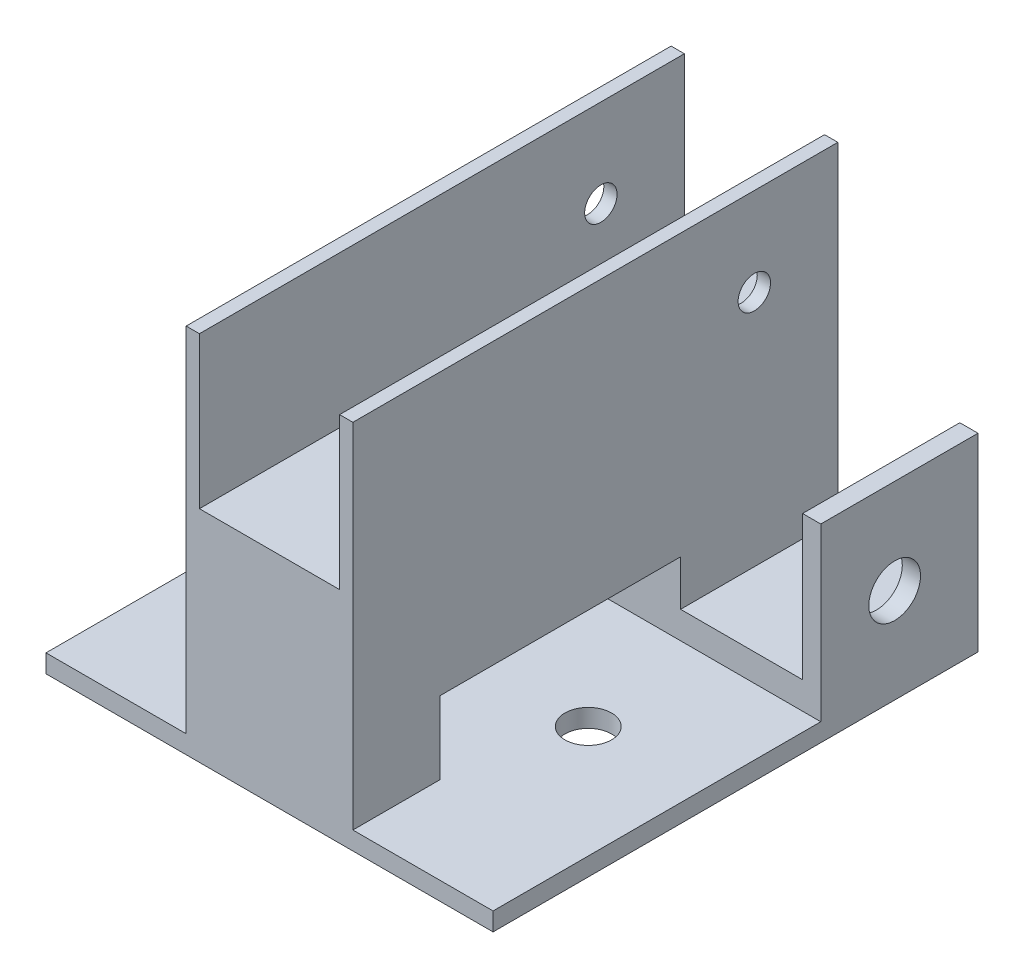
ISO-10303-21;
HEADER;
FILE_DESCRIPTION(('STEP AP214'),'2;1');
FILE_NAME('part.step','',(''),(''),'','','');
FILE_SCHEMA(('AUTOMOTIVE_DESIGN { 1 0 10303 214 1 1 1 1 }'));
ENDSEC;
DATA;
#1=APPLICATION_CONTEXT('core data for automotive mechanical design processes');
#2=APPLICATION_PROTOCOL_DEFINITION('international standard','automotive_design',2000,#1);
#3=PRODUCT_CONTEXT('',#1,'mechanical');
#4=PRODUCT('Part','Part','',(#3));
#5=PRODUCT_RELATED_PRODUCT_CATEGORY('part','',(#4));
#6=PRODUCT_DEFINITION_FORMATION('','',#4);
#7=PRODUCT_DEFINITION_CONTEXT('part definition',#1,'design');
#8=PRODUCT_DEFINITION('design','',#6,#7);
#9=PRODUCT_DEFINITION_SHAPE('','',#8);
#10=(LENGTH_UNIT() NAMED_UNIT(*) SI_UNIT(.MILLI.,.METRE.));
#11=(NAMED_UNIT(*) PLANE_ANGLE_UNIT() SI_UNIT($,.RADIAN.));
#12=(NAMED_UNIT(*) SI_UNIT($,.STERADIAN.) SOLID_ANGLE_UNIT());
#13=UNCERTAINTY_MEASURE_WITH_UNIT(LENGTH_MEASURE(1.E-05),#10,'distance_accuracy_value','');
#14=(GEOMETRIC_REPRESENTATION_CONTEXT(3) GLOBAL_UNCERTAINTY_ASSIGNED_CONTEXT((#13)) GLOBAL_UNIT_ASSIGNED_CONTEXT((#10,
#11,#12)) REPRESENTATION_CONTEXT('',''));
#15=CARTESIAN_POINT('',(0.,0.,0.));
#16=DIRECTION('',(0.,0.,1.));
#17=DIRECTION('',(1.,0.,0.));
#18=AXIS2_PLACEMENT_3D('',#15,#16,#17);
#19=CARTESIAN_POINT('',(29.5,6.,32.));
#20=DIRECTION('',(0.,-1.,0.));
#21=DIRECTION('',(0.,0.,-1.));
#22=AXIS2_PLACEMENT_3D('',#19,#20,#21);
#23=PLANE('',#22);
#24=DIRECTION('',(0.,0.,-1.));
#25=VECTOR('',#24,1.);
#26=CARTESIAN_POINT('',(-27.1,6.,-32.));
#27=LINE('',#26,#25);
#28=CARTESIAN_POINT('',(-27.1,6.,-11.25));
#29=VERTEX_POINT('',#28);
#30=CARTESIAN_POINT('',(-27.1,6.,-32.));
#31=VERTEX_POINT('',#30);
#32=EDGE_CURVE('E444',#29,#31,#27,.T.);
#33=ORIENTED_EDGE('',*,*,#32,.F.);
#34=DIRECTION('',(-1.,0.,0.));
#35=VECTOR('',#34,1.);
#36=CARTESIAN_POINT('',(0.,6.,-11.25));
#37=LINE('',#36,#35);
#38=CARTESIAN_POINT('',(-11.,6.,-11.25));
#39=VERTEX_POINT('',#38);
#40=EDGE_CURVE('E400',#39,#29,#37,.T.);
#41=ORIENTED_EDGE('',*,*,#40,.F.);
#42=DIRECTION('',(0.,0.,-1.));
#43=VECTOR('',#42,1.);
#44=CARTESIAN_POINT('',(-11.,6.,-32.));
#45=LINE('',#44,#43);
#46=CARTESIAN_POINT('',(-11.,6.,-32.));
#47=VERTEX_POINT('',#46);
#48=EDGE_CURVE('E224',#39,#47,#45,.T.);
#49=ORIENTED_EDGE('',*,*,#48,.T.);
#50=DIRECTION('',(1.,0.,0.));
#51=VECTOR('',#50,1.);
#52=CARTESIAN_POINT('',(-29.5,6.,-32.));
#53=LINE('',#52,#51);
#54=EDGE_CURVE('E215',#31,#47,#53,.T.);
#55=ORIENTED_EDGE('',*,*,#54,.F.);
#56=EDGE_LOOP('',(#33,#41,#49,#55));
#57=FACE_BOUND('',#56,.T.);
#58=ADVANCED_FACE('F38',(#57),#23,.F.);
#59=CARTESIAN_POINT('',(14.6918,49.,4.62860002304608));
#60=DIRECTION('',(0.,-1.,0.));
#61=DIRECTION('',(0.,0.,-1.));
#62=AXIS2_PLACEMENT_3D('',#59,#60,#61);
#63=CYLINDRICAL_SURFACE('',#62,3.07595313543744);
#64=CARTESIAN_POINT('',(14.6918,0.,4.62860002304608));
#65=DIRECTION('',(0.,-1.,0.));
#66=DIRECTION('',(0.,0.,-1.));
#67=AXIS2_PLACEMENT_3D('',#64,#65,#66);
#68=CIRCLE('',#67,3.07595313543744);
#69=CARTESIAN_POINT('',(14.6918,0.,1.55264688760863));
#70=VERTEX_POINT('',#69);
#71=EDGE_CURVE('E429',#70,#70,#68,.T.);
#72=ORIENTED_EDGE('',*,*,#71,.T.);
#73=EDGE_LOOP('',(#72));
#74=FACE_BOUND('',#73,.T.);
#75=CARTESIAN_POINT('',(14.6918,2.4,4.62860002304608));
#76=DIRECTION('',(0.,1.,0.));
#77=DIRECTION('',(0.,0.,1.));
#78=AXIS2_PLACEMENT_3D('',#75,#76,#77);
#79=CIRCLE('',#78,3.07595313543744);
#80=CARTESIAN_POINT('',(14.6918,2.4,7.70455315848352));
#81=VERTEX_POINT('',#80);
#82=EDGE_CURVE('E198',#81,#81,#79,.F.);
#83=ORIENTED_EDGE('',*,*,#82,.F.);
#84=EDGE_LOOP('',(#83));
#85=FACE_BOUND('',#84,.T.);
#86=ADVANCED_FACE('F336',(#74,#85),#63,.F.);
#87=CARTESIAN_POINT('',(-14.6918,49.,4.62860002304608));
#88=DIRECTION('',(0.,-1.,0.));
#89=DIRECTION('',(0.,0.,-1.));
#90=AXIS2_PLACEMENT_3D('',#87,#88,#89);
#91=CYLINDRICAL_SURFACE('',#90,3.07595313543744);
#92=CARTESIAN_POINT('',(-14.6918,0.,4.62860002304608));
#93=DIRECTION('',(0.,-1.,0.));
#94=DIRECTION('',(0.,0.,-1.));
#95=AXIS2_PLACEMENT_3D('',#92,#93,#94);
#96=CIRCLE('',#95,3.07595313543744);
#97=CARTESIAN_POINT('',(-14.6918,0.,1.55264688760864));
#98=VERTEX_POINT('',#97);
#99=EDGE_CURVE('E432',#98,#98,#96,.T.);
#100=ORIENTED_EDGE('',*,*,#99,.T.);
#101=EDGE_LOOP('',(#100));
#102=FACE_BOUND('',#101,.T.);
#103=CARTESIAN_POINT('',(-14.6918,2.4,4.62860002304608));
#104=DIRECTION('',(0.,1.,0.));
#105=DIRECTION('',(0.,0.,1.));
#106=AXIS2_PLACEMENT_3D('',#103,#104,#105);
#107=CIRCLE('',#106,3.07595313543744);
#108=CARTESIAN_POINT('',(-14.6918,2.4,7.70455315848353));
#109=VERTEX_POINT('',#108);
#110=EDGE_CURVE('E819',#109,#109,#107,.F.);
#111=ORIENTED_EDGE('',*,*,#110,.F.);
#112=EDGE_LOOP('',(#111));
#113=FACE_BOUND('',#112,.T.);
#114=ADVANCED_FACE('F343',(#102,#113),#91,.F.);
#115=CARTESIAN_POINT('',(-11.,49.,32.));
#116=DIRECTION('',(1.,0.,0.));
#117=DIRECTION('',(0.,0.,-1.));
#118=AXIS2_PLACEMENT_3D('',#115,#116,#117);
#119=PLANE('',#118);
#120=CARTESIAN_POINT('',(-11.,37.382,-20.9790410516781));
#121=DIRECTION('',(1.,0.,0.));
#122=DIRECTION('',(0.,0.,-1.));
#123=AXIS2_PLACEMENT_3D('',#120,#121,#122);
#124=CIRCLE('',#123,2.14);
#125=CARTESIAN_POINT('',(-11.,37.382,-23.1190410516781));
#126=VERTEX_POINT('',#125);
#127=EDGE_CURVE('E262',#126,#126,#124,.T.);
#128=ORIENTED_EDGE('',*,*,#127,.T.);
#129=EDGE_LOOP('',(#128));
#130=FACE_BOUND('',#129,.T.);
#131=ORIENTED_EDGE('',*,*,#48,.F.);
#132=DIRECTION('',(0.,-1.,0.));
#133=VECTOR('',#132,1.);
#134=CARTESIAN_POINT('',(-11.,6.,-11.25));
#135=LINE('',#134,#133);
#136=CARTESIAN_POINT('',(-11.,12.,-11.25));
#137=VERTEX_POINT('',#136);
#138=EDGE_CURVE('E419',#137,#39,#135,.T.);
#139=ORIENTED_EDGE('',*,*,#138,.F.);
#140=DIRECTION('',(0.,0.,-1.));
#141=VECTOR('',#140,1.);
#142=CARTESIAN_POINT('',(-11.,12.,-11.25));
#143=LINE('',#142,#141);
#144=CARTESIAN_POINT('',(-11.,12.,20.5));
#145=VERTEX_POINT('',#144);
#146=EDGE_CURVE('E413',#145,#137,#143,.T.);
#147=ORIENTED_EDGE('',*,*,#146,.F.);
#148=DIRECTION('',(0.,1.,0.));
#149=VECTOR('',#148,1.);
#150=CARTESIAN_POINT('',(-11.,6.,20.5));
#151=LINE('',#150,#149);
#152=CARTESIAN_POINT('',(-11.,2.4,20.5));
#153=VERTEX_POINT('',#152);
#154=EDGE_CURVE('E416',#153,#145,#151,.T.);
#155=ORIENTED_EDGE('',*,*,#154,.F.);
#156=DIRECTION('',(0.,0.,-1.));
#157=VECTOR('',#156,1.);
#158=CARTESIAN_POINT('',(-11.,2.4,0.));
#159=LINE('',#158,#157);
#160=CARTESIAN_POINT('',(-11.,2.4,32.));
#161=VERTEX_POINT('',#160);
#162=EDGE_CURVE('E207',#161,#153,#159,.T.);
#163=ORIENTED_EDGE('',*,*,#162,.F.);
#164=DIRECTION('',(0.,-1.,0.));
#165=VECTOR('',#164,1.);
#166=CARTESIAN_POINT('',(-11.,49.,32.));
#167=LINE('',#166,#165);
#168=CARTESIAN_POINT('',(-11.,49.,32.));
#169=VERTEX_POINT('',#168);
#170=EDGE_CURVE('E11',#169,#161,#167,.T.);
#171=ORIENTED_EDGE('',*,*,#170,.F.);
#172=DIRECTION('',(0.,0.,1.));
#173=VECTOR('',#172,1.);
#174=CARTESIAN_POINT('',(-11.,49.,32.));
#175=LINE('',#174,#173);
#176=CARTESIAN_POINT('',(-11.,49.,-32.));
#177=VERTEX_POINT('',#176);
#178=EDGE_CURVE('E292',#177,#169,#175,.T.);
#179=ORIENTED_EDGE('',*,*,#178,.F.);
#180=DIRECTION('',(0.,-1.,0.));
#181=VECTOR('',#180,1.);
#182=CARTESIAN_POINT('',(-11.,49.,-32.));
#183=LINE('',#182,#181);
#184=EDGE_CURVE('E306',#177,#47,#183,.T.);
#185=ORIENTED_EDGE('',*,*,#184,.T.);
#186=EDGE_LOOP('',(#131,#139,#147,#155,#163,#171,#179,#185));
#187=FACE_BOUND('',#186,.T.);
#188=ADVANCED_FACE('F40',(#130,#187),#119,.F.);
#189=DIRECTION('',(0.,0.,1.));
#190=VECTOR('',#189,1.);
#191=CARTESIAN_POINT('',(11.,6.,32.));
#192=LINE('',#191,#190);
#193=CARTESIAN_POINT('',(11.,6.,-32.));
#194=VERTEX_POINT('',#193);
#195=CARTESIAN_POINT('',(11.,6.,-11.25));
#196=VERTEX_POINT('',#195);
#197=EDGE_CURVE('E242',#194,#196,#192,.T.);
#198=ORIENTED_EDGE('',*,*,#197,.T.);
#199=CARTESIAN_POINT('',(27.1,6.,-11.25));
#200=VERTEX_POINT('',#199);
#201=EDGE_CURVE('E362',#200,#196,#37,.T.);
#202=ORIENTED_EDGE('',*,*,#201,.F.);
#203=DIRECTION('',(0.,0.,1.));
#204=VECTOR('',#203,1.);
#205=CARTESIAN_POINT('',(27.1,6.,-32.));
#206=LINE('',#205,#204);
#207=CARTESIAN_POINT('',(27.1,6.,-32.));
#208=VERTEX_POINT('',#207);
#209=EDGE_CURVE('E234',#208,#200,#206,.T.);
#210=ORIENTED_EDGE('',*,*,#209,.F.);
#211=DIRECTION('',(-1.,0.,0.));
#212=VECTOR('',#211,1.);
#213=CARTESIAN_POINT('',(29.5,6.,-32.));
#214=LINE('',#213,#212);
#215=EDGE_CURVE('E251',#208,#194,#214,.T.);
#216=ORIENTED_EDGE('',*,*,#215,.T.);
#217=EDGE_LOOP('',(#198,#202,#210,#216));
#218=FACE_BOUND('',#217,.T.);
#219=ADVANCED_FACE('F339',(#218),#23,.F.);
#220=CARTESIAN_POINT('',(11.,49.,32.));
#221=DIRECTION('',(-1.,0.,0.));
#222=DIRECTION('',(0.,0.,1.));
#223=AXIS2_PLACEMENT_3D('',#220,#221,#222);
#224=PLANE('',#223);
#225=CARTESIAN_POINT('',(11.,37.382,-20.9790410516781));
#226=DIRECTION('',(1.,0.,0.));
#227=DIRECTION('',(0.,0.,-1.));
#228=AXIS2_PLACEMENT_3D('',#225,#226,#227);
#229=CIRCLE('',#228,2.14);
#230=CARTESIAN_POINT('',(11.,37.382,-23.1190410516781));
#231=VERTEX_POINT('',#230);
#232=EDGE_CURVE('E255',#231,#231,#229,.T.);
#233=ORIENTED_EDGE('',*,*,#232,.F.);
#234=EDGE_LOOP('',(#233));
#235=FACE_BOUND('',#234,.T.);
#236=DIRECTION('',(0.,0.,1.));
#237=VECTOR('',#236,1.);
#238=CARTESIAN_POINT('',(11.,12.,-11.25));
#239=LINE('',#238,#237);
#240=CARTESIAN_POINT('',(11.,12.,-11.25));
#241=VERTEX_POINT('',#240);
#242=CARTESIAN_POINT('',(11.,12.,20.5));
#243=VERTEX_POINT('',#242);
#244=EDGE_CURVE('E424',#241,#243,#239,.T.);
#245=ORIENTED_EDGE('',*,*,#244,.F.);
#246=DIRECTION('',(0.,1.,0.));
#247=VECTOR('',#246,1.);
#248=CARTESIAN_POINT('',(11.,6.,-11.25));
#249=LINE('',#248,#247);
#250=EDGE_CURVE('E372',#196,#241,#249,.T.);
#251=ORIENTED_EDGE('',*,*,#250,.F.);
#252=ORIENTED_EDGE('',*,*,#197,.F.);
#253=DIRECTION('',(0.,-1.,0.));
#254=VECTOR('',#253,1.);
#255=CARTESIAN_POINT('',(11.,49.,-32.));
#256=LINE('',#255,#254);
#257=CARTESIAN_POINT('',(11.,49.,-32.));
#258=VERTEX_POINT('',#257);
#259=EDGE_CURVE('E311',#258,#194,#256,.T.);
#260=ORIENTED_EDGE('',*,*,#259,.F.);
#261=DIRECTION('',(0.,0.,-1.));
#262=VECTOR('',#261,1.);
#263=CARTESIAN_POINT('',(11.,49.,32.));
#264=LINE('',#263,#262);
#265=CARTESIAN_POINT('',(11.,49.,32.));
#266=VERTEX_POINT('',#265);
#267=EDGE_CURVE('E300',#266,#258,#264,.T.);
#268=ORIENTED_EDGE('',*,*,#267,.F.);
#269=DIRECTION('',(0.,-1.,0.));
#270=VECTOR('',#269,1.);
#271=CARTESIAN_POINT('',(11.,49.,32.));
#272=LINE('',#271,#270);
#273=CARTESIAN_POINT('',(11.,2.4,32.));
#274=VERTEX_POINT('',#273);
#275=EDGE_CURVE('E47',#266,#274,#272,.T.);
#276=ORIENTED_EDGE('',*,*,#275,.T.);
#277=DIRECTION('',(0.,0.,1.));
#278=VECTOR('',#277,1.);
#279=CARTESIAN_POINT('',(11.,2.4,0.));
#280=LINE('',#279,#278);
#281=CARTESIAN_POINT('',(11.,2.4,20.5));
#282=VERTEX_POINT('',#281);
#283=EDGE_CURVE('E384',#282,#274,#280,.T.);
#284=ORIENTED_EDGE('',*,*,#283,.F.);
#285=DIRECTION('',(0.,-1.,0.));
#286=VECTOR('',#285,1.);
#287=CARTESIAN_POINT('',(11.,6.,20.5));
#288=LINE('',#287,#286);
#289=EDGE_CURVE('E427',#243,#282,#288,.T.);
#290=ORIENTED_EDGE('',*,*,#289,.F.);
#291=EDGE_LOOP('',(#245,#251,#252,#260,#268,#276,#284,#290));
#292=FACE_BOUND('',#291,.T.);
#293=ADVANCED_FACE('F350',(#235,#292),#224,.F.);
#294=CARTESIAN_POINT('',(0.,49.,0.));
#295=DIRECTION('',(0.,1.,0.));
#296=DIRECTION('',(0.,0.,1.));
#297=AXIS2_PLACEMENT_3D('',#294,#295,#296);
#298=PLANE('',#297);
#299=DIRECTION('',(0.,0.,-1.));
#300=VECTOR('',#299,1.);
#301=CARTESIAN_POINT('',(9.25,49.,-32.));
#302=LINE('',#301,#300);
#303=CARTESIAN_POINT('',(9.25,49.,32.));
#304=VERTEX_POINT('',#303);
#305=CARTESIAN_POINT('',(9.25,49.,-32.));
#306=VERTEX_POINT('',#305);
#307=EDGE_CURVE('E265',#304,#306,#302,.T.);
#308=ORIENTED_EDGE('',*,*,#307,.F.);
#309=DIRECTION('',(1.,0.,0.));
#310=VECTOR('',#309,1.);
#311=CARTESIAN_POINT('',(11.,49.,32.));
#312=LINE('',#311,#310);
#313=EDGE_CURVE('E295',#304,#266,#312,.T.);
#314=ORIENTED_EDGE('',*,*,#313,.T.);
#315=ORIENTED_EDGE('',*,*,#267,.T.);
#316=DIRECTION('',(-1.,0.,0.));
#317=VECTOR('',#316,1.);
#318=CARTESIAN_POINT('',(11.,49.,-32.));
#319=LINE('',#318,#317);
#320=EDGE_CURVE('E303',#258,#306,#319,.T.);
#321=ORIENTED_EDGE('',*,*,#320,.T.);
#322=EDGE_LOOP('',(#308,#314,#315,#321));
#323=FACE_BOUND('',#322,.T.);
#324=ADVANCED_FACE('F356',(#323),#298,.T.);
#325=CARTESIAN_POINT('',(11.,49.,32.));
#326=DIRECTION('',(0.,0.,-1.));
#327=DIRECTION('',(-1.,0.,0.));
#328=AXIS2_PLACEMENT_3D('',#325,#326,#327);
#329=PLANE('',#328);
#330=ORIENTED_EDGE('',*,*,#170,.T.);
#331=DIRECTION('',(1.,0.,0.));
#332=VECTOR('',#331,1.);
#333=CARTESIAN_POINT('',(0.,2.4,32.));
#334=LINE('',#333,#332);
#335=CARTESIAN_POINT('',(-29.5,2.4,32.));
#336=VERTEX_POINT('',#335);
#337=EDGE_CURVE('E192',#336,#161,#334,.T.);
#338=ORIENTED_EDGE('',*,*,#337,.F.);
#339=DIRECTION('',(0.,1.,0.));
#340=VECTOR('',#339,1.);
#341=CARTESIAN_POINT('',(-29.5,6.,32.));
#342=LINE('',#341,#340);
#343=CARTESIAN_POINT('',(-29.5,0.,32.));
#344=VERTEX_POINT('',#343);
#345=EDGE_CURVE('E204',#344,#336,#342,.T.);
#346=ORIENTED_EDGE('',*,*,#345,.F.);
#347=DIRECTION('',(1.,0.,0.));
#348=VECTOR('',#347,1.);
#349=CARTESIAN_POINT('',(11.,0.,32.));
#350=LINE('',#349,#348);
#351=CARTESIAN_POINT('',(29.5,0.,32.));
#352=VERTEX_POINT('',#351);
#353=EDGE_CURVE('E284',#344,#352,#350,.T.);
#354=ORIENTED_EDGE('',*,*,#353,.T.);
#355=DIRECTION('',(0.,-1.,0.));
#356=VECTOR('',#355,1.);
#357=CARTESIAN_POINT('',(29.5,6.,32.));
#358=LINE('',#357,#356);
#359=CARTESIAN_POINT('',(29.5,2.4,32.));
#360=VERTEX_POINT('',#359);
#361=EDGE_CURVE('E243',#360,#352,#358,.T.);
#362=ORIENTED_EDGE('',*,*,#361,.F.);
#363=DIRECTION('',(1.,0.,0.));
#364=VECTOR('',#363,1.);
#365=CARTESIAN_POINT('',(0.,2.4,32.));
#366=LINE('',#365,#364);
#367=EDGE_CURVE('E387',#274,#360,#366,.T.);
#368=ORIENTED_EDGE('',*,*,#367,.F.);
#369=ORIENTED_EDGE('',*,*,#275,.F.);
#370=ORIENTED_EDGE('',*,*,#313,.F.);
#371=DIRECTION('',(0.,1.,0.));
#372=VECTOR('',#371,1.);
#373=CARTESIAN_POINT('',(9.25,29.,32.));
#374=LINE('',#373,#372);
#375=CARTESIAN_POINT('',(9.25,29.,32.));
#376=VERTEX_POINT('',#375);
#377=EDGE_CURVE('E282',#376,#304,#374,.T.);
#378=ORIENTED_EDGE('',*,*,#377,.F.);
#379=DIRECTION('',(1.,0.,0.));
#380=VECTOR('',#379,1.);
#381=CARTESIAN_POINT('',(-9.25,29.,32.));
#382=LINE('',#381,#380);
#383=CARTESIAN_POINT('',(-9.25,29.,32.));
#384=VERTEX_POINT('',#383);
#385=EDGE_CURVE('E276',#384,#376,#382,.T.);
#386=ORIENTED_EDGE('',*,*,#385,.F.);
#387=DIRECTION('',(0.,1.,0.));
#388=VECTOR('',#387,1.);
#389=CARTESIAN_POINT('',(-9.25,29.,32.));
#390=LINE('',#389,#388);
#391=CARTESIAN_POINT('',(-9.25,49.,32.));
#392=VERTEX_POINT('',#391);
#393=EDGE_CURVE('E285',#384,#392,#390,.T.);
#394=ORIENTED_EDGE('',*,*,#393,.T.);
#395=EDGE_CURVE('E297',#169,#392,#312,.T.);
#396=ORIENTED_EDGE('',*,*,#395,.F.);
#397=EDGE_LOOP('',(#330,#338,#346,#354,#362,#368,#369,#370,#378,#386,#394,#396));
#398=FACE_BOUND('',#397,.T.);
#399=ADVANCED_FACE('F202',(#398),#329,.F.);
#400=CARTESIAN_POINT('',(11.,49.,-32.));
#401=DIRECTION('',(0.,0.,1.));
#402=DIRECTION('',(1.,0.,0.));
#403=AXIS2_PLACEMENT_3D('',#400,#401,#402);
#404=PLANE('',#403);
#405=DIRECTION('',(-1.,0.,0.));
#406=VECTOR('',#405,1.);
#407=CARTESIAN_POINT('',(-9.25,29.,-32.));
#408=LINE('',#407,#406);
#409=CARTESIAN_POINT('',(9.25,29.,-32.));
#410=VERTEX_POINT('',#409);
#411=CARTESIAN_POINT('',(-9.25,29.,-32.));
#412=VERTEX_POINT('',#411);
#413=EDGE_CURVE('E269',#410,#412,#408,.T.);
#414=ORIENTED_EDGE('',*,*,#413,.F.);
#415=DIRECTION('',(0.,1.,0.));
#416=VECTOR('',#415,1.);
#417=CARTESIAN_POINT('',(9.25,29.,-32.));
#418=LINE('',#417,#416);
#419=EDGE_CURVE('E279',#410,#306,#418,.T.);
#420=ORIENTED_EDGE('',*,*,#419,.T.);
#421=ORIENTED_EDGE('',*,*,#320,.F.);
#422=ORIENTED_EDGE('',*,*,#259,.T.);
#423=ORIENTED_EDGE('',*,*,#215,.F.);
#424=DIRECTION('',(0.,-1.,0.));
#425=VECTOR('',#424,1.);
#426=CARTESIAN_POINT('',(27.1,25.,-32.));
#427=LINE('',#426,#425);
#428=CARTESIAN_POINT('',(27.1,25.,-32.));
#429=VERTEX_POINT('',#428);
#430=EDGE_CURVE('E238',#429,#208,#427,.T.);
#431=ORIENTED_EDGE('',*,*,#430,.F.);
#432=DIRECTION('',(-1.,0.,0.));
#433=VECTOR('',#432,1.);
#434=CARTESIAN_POINT('',(27.1,25.,-32.));
#435=LINE('',#434,#433);
#436=CARTESIAN_POINT('',(29.5,25.,-32.));
#437=VERTEX_POINT('',#436);
#438=EDGE_CURVE('E236',#437,#429,#435,.T.);
#439=ORIENTED_EDGE('',*,*,#438,.F.);
#440=DIRECTION('',(0.,1.,0.));
#441=VECTOR('',#440,1.);
#442=CARTESIAN_POINT('',(29.5,6.,-32.));
#443=LINE('',#442,#441);
#444=CARTESIAN_POINT('',(29.5,0.,-32.));
#445=VERTEX_POINT('',#444);
#446=EDGE_CURVE('E248',#445,#437,#443,.T.);
#447=ORIENTED_EDGE('',*,*,#446,.F.);
#448=DIRECTION('',(-1.,0.,0.));
#449=VECTOR('',#448,1.);
#450=CARTESIAN_POINT('',(11.,0.,-32.));
#451=LINE('',#450,#449);
#452=CARTESIAN_POINT('',(-29.5,0.,-32.));
#453=VERTEX_POINT('',#452);
#454=EDGE_CURVE('E296',#445,#453,#451,.T.);
#455=ORIENTED_EDGE('',*,*,#454,.T.);
#456=DIRECTION('',(0.,-1.,0.));
#457=VECTOR('',#456,1.);
#458=CARTESIAN_POINT('',(-29.5,6.,-32.));
#459=LINE('',#458,#457);
#460=CARTESIAN_POINT('',(-29.5,25.,-32.));
#461=VERTEX_POINT('',#460);
#462=EDGE_CURVE('E220',#461,#453,#459,.T.);
#463=ORIENTED_EDGE('',*,*,#462,.F.);
#464=DIRECTION('',(-1.,0.,0.));
#465=VECTOR('',#464,1.);
#466=CARTESIAN_POINT('',(-29.5,25.,-32.));
#467=LINE('',#466,#465);
#468=CARTESIAN_POINT('',(-27.1,25.,-32.));
#469=VERTEX_POINT('',#468);
#470=EDGE_CURVE('E446',#469,#461,#467,.T.);
#471=ORIENTED_EDGE('',*,*,#470,.F.);
#472=DIRECTION('',(0.,-1.,0.));
#473=VECTOR('',#472,1.);
#474=CARTESIAN_POINT('',(-27.1,25.,-32.));
#475=LINE('',#474,#473);
#476=EDGE_CURVE('E225',#469,#31,#475,.T.);
#477=ORIENTED_EDGE('',*,*,#476,.T.);
#478=ORIENTED_EDGE('',*,*,#54,.T.);
#479=ORIENTED_EDGE('',*,*,#184,.F.);
#480=CARTESIAN_POINT('',(-9.25,49.,-32.));
#481=VERTEX_POINT('',#480);
#482=EDGE_CURVE('E302',#481,#177,#319,.T.);
#483=ORIENTED_EDGE('',*,*,#482,.F.);
#484=DIRECTION('',(0.,1.,0.));
#485=VECTOR('',#484,1.);
#486=CARTESIAN_POINT('',(-9.25,29.,-32.));
#487=LINE('',#486,#485);
#488=EDGE_CURVE('E288',#412,#481,#487,.T.);
#489=ORIENTED_EDGE('',*,*,#488,.F.);
#490=EDGE_LOOP('',(#414,#420,#421,#422,#423,#431,#439,#447,#455,#463,#471,#477,#478,#479,#483,#489));
#491=FACE_BOUND('',#490,.T.);
#492=ADVANCED_FACE('F375',(#491),#404,.F.);
#493=DIRECTION('',(0.,0.,1.));
#494=VECTOR('',#493,1.);
#495=CARTESIAN_POINT('',(-9.25,49.,-32.));
#496=LINE('',#495,#494);
#497=EDGE_CURVE('E270',#481,#392,#496,.T.);
#498=ORIENTED_EDGE('',*,*,#497,.F.);
#499=ORIENTED_EDGE('',*,*,#482,.T.);
#500=ORIENTED_EDGE('',*,*,#178,.T.);
#501=ORIENTED_EDGE('',*,*,#395,.T.);
#502=EDGE_LOOP('',(#498,#499,#500,#501));
#503=FACE_BOUND('',#502,.T.);
#504=ADVANCED_FACE('F470',(#503),#298,.T.);
#505=CARTESIAN_POINT('',(0.,0.,0.));
#506=DIRECTION('',(0.,1.,0.));
#507=DIRECTION('',(0.,0.,1.));
#508=AXIS2_PLACEMENT_3D('',#505,#506,#507);
#509=PLANE('',#508);
#510=ORIENTED_EDGE('',*,*,#99,.F.);
#511=EDGE_LOOP('',(#510));
#512=FACE_BOUND('',#511,.T.);
#513=ORIENTED_EDGE('',*,*,#71,.F.);
#514=EDGE_LOOP('',(#513));
#515=FACE_BOUND('',#514,.T.);
#516=ORIENTED_EDGE('',*,*,#353,.F.);
#517=DIRECTION('',(0.,0.,1.));
#518=VECTOR('',#517,1.);
#519=CARTESIAN_POINT('',(-29.5,0.,-32.));
#520=LINE('',#519,#518);
#521=EDGE_CURVE('E214',#453,#344,#520,.T.);
#522=ORIENTED_EDGE('',*,*,#521,.F.);
#523=ORIENTED_EDGE('',*,*,#454,.F.);
#524=DIRECTION('',(0.,0.,-1.));
#525=VECTOR('',#524,1.);
#526=CARTESIAN_POINT('',(29.5,0.,32.));
#527=LINE('',#526,#525);
#528=EDGE_CURVE('E245',#352,#445,#527,.T.);
#529=ORIENTED_EDGE('',*,*,#528,.F.);
#530=EDGE_LOOP('',(#516,#522,#523,#529));
#531=FACE_BOUND('',#530,.T.);
#532=ADVANCED_FACE('F480',(#512,#515,#531),#509,.F.);
#533=CARTESIAN_POINT('',(9.25,29.,-32.));
#534=DIRECTION('',(1.,0.,0.));
#535=DIRECTION('',(0.,0.,-1.));
#536=AXIS2_PLACEMENT_3D('',#533,#534,#535);
#537=PLANE('',#536);
#538=CARTESIAN_POINT('',(9.25,37.382,-20.9790410516781));
#539=DIRECTION('',(1.,0.,0.));
#540=DIRECTION('',(0.,0.,-1.));
#541=AXIS2_PLACEMENT_3D('',#538,#539,#540);
#542=CIRCLE('',#541,2.14);
#543=CARTESIAN_POINT('',(9.25,37.382,-23.1190410516781));
#544=VERTEX_POINT('',#543);
#545=EDGE_CURVE('E259',#544,#544,#542,.T.);
#546=ORIENTED_EDGE('',*,*,#545,.T.);
#547=EDGE_LOOP('',(#546));
#548=FACE_BOUND('',#547,.T.);
#549=ORIENTED_EDGE('',*,*,#307,.T.);
#550=ORIENTED_EDGE('',*,*,#419,.F.);
#551=DIRECTION('',(0.,0.,-1.));
#552=VECTOR('',#551,1.);
#553=CARTESIAN_POINT('',(9.25,29.,-32.));
#554=LINE('',#553,#552);
#555=EDGE_CURVE('E266',#376,#410,#554,.T.);
#556=ORIENTED_EDGE('',*,*,#555,.F.);
#557=ORIENTED_EDGE('',*,*,#377,.T.);
#558=EDGE_LOOP('',(#549,#550,#556,#557));
#559=FACE_BOUND('',#558,.T.);
#560=ADVANCED_FACE('F478',(#548,#559),#537,.F.);
#561=CARTESIAN_POINT('',(-9.25,29.,-32.));
#562=DIRECTION('',(-1.,0.,0.));
#563=DIRECTION('',(0.,0.,1.));
#564=AXIS2_PLACEMENT_3D('',#561,#562,#563);
#565=PLANE('',#564);
#566=CARTESIAN_POINT('',(-9.25,37.382,-20.9790410516781));
#567=DIRECTION('',(-1.,0.,0.));
#568=DIRECTION('',(0.,0.,1.));
#569=AXIS2_PLACEMENT_3D('',#566,#567,#568);
#570=CIRCLE('',#569,2.14);
#571=CARTESIAN_POINT('',(-9.25,37.382,-18.8390410516781));
#572=VERTEX_POINT('',#571);
#573=EDGE_CURVE('E258',#572,#572,#570,.T.);
#574=ORIENTED_EDGE('',*,*,#573,.T.);
#575=EDGE_LOOP('',(#574));
#576=FACE_BOUND('',#575,.T.);
#577=ORIENTED_EDGE('',*,*,#497,.T.);
#578=ORIENTED_EDGE('',*,*,#393,.F.);
#579=DIRECTION('',(0.,0.,1.));
#580=VECTOR('',#579,1.);
#581=CARTESIAN_POINT('',(-9.25,29.,-32.));
#582=LINE('',#581,#580);
#583=EDGE_CURVE('E273',#412,#384,#582,.T.);
#584=ORIENTED_EDGE('',*,*,#583,.F.);
#585=ORIENTED_EDGE('',*,*,#488,.T.);
#586=EDGE_LOOP('',(#577,#578,#584,#585));
#587=FACE_BOUND('',#586,.T.);
#588=ADVANCED_FACE('F472',(#576,#587),#565,.F.);
#589=CARTESIAN_POINT('',(0.,29.,0.));
#590=DIRECTION('',(0.,1.,0.));
#591=DIRECTION('',(0.,0.,1.));
#592=AXIS2_PLACEMENT_3D('',#589,#590,#591);
#593=PLANE('',#592);
#594=ORIENTED_EDGE('',*,*,#555,.T.);
#595=ORIENTED_EDGE('',*,*,#413,.T.);
#596=ORIENTED_EDGE('',*,*,#583,.T.);
#597=ORIENTED_EDGE('',*,*,#385,.T.);
#598=EDGE_LOOP('',(#594,#595,#596,#597));
#599=FACE_BOUND('',#598,.T.);
#600=ADVANCED_FACE('F476',(#599),#593,.T.);
#601=CARTESIAN_POINT('',(-17.,37.382,-20.9790410516781));
#602=DIRECTION('',(1.,0.,0.));
#603=DIRECTION('',(0.,0.,-1.));
#604=AXIS2_PLACEMENT_3D('',#601,#602,#603);
#605=CYLINDRICAL_SURFACE('',#604,2.14);
#606=ORIENTED_EDGE('',*,*,#573,.F.);
#607=EDGE_LOOP('',(#606));
#608=FACE_BOUND('',#607,.T.);
#609=ORIENTED_EDGE('',*,*,#127,.F.);
#610=EDGE_LOOP('',(#609));
#611=FACE_BOUND('',#610,.T.);
#612=ADVANCED_FACE('F762',(#608,#611),#605,.F.);
#613=ORIENTED_EDGE('',*,*,#232,.T.);
#614=EDGE_LOOP('',(#613));
#615=FACE_BOUND('',#614,.T.);
#616=ORIENTED_EDGE('',*,*,#545,.F.);
#617=EDGE_LOOP('',(#616));
#618=FACE_BOUND('',#617,.T.);
#619=ADVANCED_FACE('F529',(#615,#618),#605,.F.);
#620=CARTESIAN_POINT('',(29.5,0.,0.));
#621=DIRECTION('',(1.,0.,0.));
#622=DIRECTION('',(0.,0.,-1.));
#623=AXIS2_PLACEMENT_3D('',#620,#621,#622);
#624=PLANE('',#623);
#625=DIRECTION('',(0.,1.,0.));
#626=VECTOR('',#625,1.);
#627=CARTESIAN_POINT('',(29.5,5.99999999999999,-11.25));
#628=LINE('',#627,#626);
#629=CARTESIAN_POINT('',(29.5,2.4,-11.25));
#630=VERTEX_POINT('',#629);
#631=CARTESIAN_POINT('',(29.5,25.,-11.25));
#632=VERTEX_POINT('',#631);
#633=EDGE_CURVE('E55',#630,#632,#628,.T.);
#634=ORIENTED_EDGE('',*,*,#633,.F.);
#635=DIRECTION('',(0.,0.,-1.));
#636=VECTOR('',#635,1.);
#637=CARTESIAN_POINT('',(29.5,2.4,0.));
#638=LINE('',#637,#636);
#639=EDGE_CURVE('E393',#360,#630,#638,.T.);
#640=ORIENTED_EDGE('',*,*,#639,.F.);
#641=ORIENTED_EDGE('',*,*,#361,.T.);
#642=ORIENTED_EDGE('',*,*,#528,.T.);
#643=ORIENTED_EDGE('',*,*,#446,.T.);
#644=DIRECTION('',(0.,0.,-1.));
#645=VECTOR('',#644,1.);
#646=CARTESIAN_POINT('',(29.5,25.,-32.));
#647=LINE('',#646,#645);
#648=EDGE_CURVE('E233',#632,#437,#647,.T.);
#649=ORIENTED_EDGE('',*,*,#648,.F.);
#650=EDGE_LOOP('',(#634,#640,#641,#642,#643,#649));
#651=FACE_BOUND('',#650,.T.);
#652=CARTESIAN_POINT('',(29.5,12.5,-21.));
#653=DIRECTION('',(1.,0.,0.));
#654=DIRECTION('',(0.,0.,-1.));
#655=AXIS2_PLACEMENT_3D('',#652,#653,#654);
#656=CIRCLE('',#655,3.41);
#657=CARTESIAN_POINT('',(29.5,12.5,-24.41));
#658=VERTEX_POINT('',#657);
#659=EDGE_CURVE('E218',#658,#658,#656,.T.);
#660=ORIENTED_EDGE('',*,*,#659,.F.);
#661=EDGE_LOOP('',(#660));
#662=FACE_BOUND('',#661,.T.);
#663=ADVANCED_FACE('F524',(#651,#662),#624,.T.);
#664=CARTESIAN_POINT('',(27.1,25.,-32.));
#665=DIRECTION('',(1.,0.,0.));
#666=DIRECTION('',(0.,0.,-1.));
#667=AXIS2_PLACEMENT_3D('',#664,#665,#666);
#668=PLANE('',#667);
#669=CARTESIAN_POINT('',(27.1,12.5,-21.));
#670=DIRECTION('',(1.,0.,0.));
#671=DIRECTION('',(0.,0.,-1.));
#672=AXIS2_PLACEMENT_3D('',#669,#670,#671);
#673=CIRCLE('',#672,3.41);
#674=CARTESIAN_POINT('',(27.1,12.5,-24.41));
#675=VERTEX_POINT('',#674);
#676=EDGE_CURVE('E229',#675,#675,#673,.T.);
#677=ORIENTED_EDGE('',*,*,#676,.T.);
#678=EDGE_LOOP('',(#677));
#679=FACE_BOUND('',#678,.T.);
#680=ORIENTED_EDGE('',*,*,#209,.T.);
#681=DIRECTION('',(0.,1.,0.));
#682=VECTOR('',#681,1.);
#683=CARTESIAN_POINT('',(27.1,5.99999999999999,-11.25));
#684=LINE('',#683,#682);
#685=CARTESIAN_POINT('',(27.1,25.,-11.25));
#686=VERTEX_POINT('',#685);
#687=EDGE_CURVE('E403',#200,#686,#684,.T.);
#688=ORIENTED_EDGE('',*,*,#687,.T.);
#689=DIRECTION('',(0.,0.,1.));
#690=VECTOR('',#689,1.);
#691=CARTESIAN_POINT('',(27.1,25.,-32.));
#692=LINE('',#691,#690);
#693=EDGE_CURVE('E230',#429,#686,#692,.T.);
#694=ORIENTED_EDGE('',*,*,#693,.F.);
#695=ORIENTED_EDGE('',*,*,#430,.T.);
#696=EDGE_LOOP('',(#680,#688,#694,#695));
#697=FACE_BOUND('',#696,.T.);
#698=ADVANCED_FACE('F319',(#679,#697),#668,.F.);
#699=CARTESIAN_POINT('',(0.,25.,0.));
#700=DIRECTION('',(0.,1.,0.));
#701=DIRECTION('',(0.,0.,1.));
#702=AXIS2_PLACEMENT_3D('',#699,#700,#701);
#703=PLANE('',#702);
#704=DIRECTION('',(-1.,0.,0.));
#705=VECTOR('',#704,1.);
#706=CARTESIAN_POINT('',(29.5,25.,-11.25));
#707=LINE('',#706,#705);
#708=EDGE_CURVE('E399',#632,#686,#707,.T.);
#709=ORIENTED_EDGE('',*,*,#708,.F.);
#710=ORIENTED_EDGE('',*,*,#648,.T.);
#711=ORIENTED_EDGE('',*,*,#438,.T.);
#712=ORIENTED_EDGE('',*,*,#693,.T.);
#713=EDGE_LOOP('',(#709,#710,#711,#712));
#714=FACE_BOUND('',#713,.T.);
#715=ADVANCED_FACE('F324',(#714),#703,.T.);
#716=CARTESIAN_POINT('',(16.5,12.5,-21.));
#717=DIRECTION('',(1.,0.,0.));
#718=DIRECTION('',(0.,0.,-1.));
#719=AXIS2_PLACEMENT_3D('',#716,#717,#718);
#720=CYLINDRICAL_SURFACE('',#719,3.41);
#721=ORIENTED_EDGE('',*,*,#659,.T.);
#722=EDGE_LOOP('',(#721));
#723=FACE_BOUND('',#722,.T.);
#724=ORIENTED_EDGE('',*,*,#676,.F.);
#725=EDGE_LOOP('',(#724));
#726=FACE_BOUND('',#725,.T.);
#727=ADVANCED_FACE('F322',(#723,#726),#720,.F.);
#728=CARTESIAN_POINT('',(-29.5,0.,0.));
#729=DIRECTION('',(-1.,0.,0.));
#730=DIRECTION('',(0.,0.,1.));
#731=AXIS2_PLACEMENT_3D('',#728,#729,#730);
#732=PLANE('',#731);
#733=DIRECTION('',(0.,0.,1.));
#734=VECTOR('',#733,1.);
#735=CARTESIAN_POINT('',(-29.5,2.4,0.));
#736=LINE('',#735,#734);
#737=CARTESIAN_POINT('',(-29.5,2.4,-11.25));
#738=VERTEX_POINT('',#737);
#739=EDGE_CURVE('E188',#738,#336,#736,.T.);
#740=ORIENTED_EDGE('',*,*,#739,.F.);
#741=DIRECTION('',(0.,1.,0.));
#742=VECTOR('',#741,1.);
#743=CARTESIAN_POINT('',(-29.5,5.99999999999999,-11.25));
#744=LINE('',#743,#742);
#745=CARTESIAN_POINT('',(-29.5,25.,-11.25));
#746=VERTEX_POINT('',#745);
#747=EDGE_CURVE('E409',#738,#746,#744,.T.);
#748=ORIENTED_EDGE('',*,*,#747,.T.);
#749=DIRECTION('',(0.,0.,1.));
#750=VECTOR('',#749,1.);
#751=CARTESIAN_POINT('',(-29.5,25.,-32.));
#752=LINE('',#751,#750);
#753=EDGE_CURVE('E440',#461,#746,#752,.T.);
#754=ORIENTED_EDGE('',*,*,#753,.F.);
#755=ORIENTED_EDGE('',*,*,#462,.T.);
#756=ORIENTED_EDGE('',*,*,#521,.T.);
#757=ORIENTED_EDGE('',*,*,#345,.T.);
#758=EDGE_LOOP('',(#740,#748,#754,#755,#756,#757));
#759=FACE_BOUND('',#758,.T.);
#760=CARTESIAN_POINT('',(-29.5,12.5,-21.));
#761=DIRECTION('',(-1.,0.,0.));
#762=DIRECTION('',(0.,0.,1.));
#763=AXIS2_PLACEMENT_3D('',#760,#761,#762);
#764=CIRCLE('',#763,3.41);
#765=CARTESIAN_POINT('',(-29.5,12.5,-17.59));
#766=VERTEX_POINT('',#765);
#767=EDGE_CURVE('E435',#766,#766,#764,.T.);
#768=ORIENTED_EDGE('',*,*,#767,.F.);
#769=EDGE_LOOP('',(#768));
#770=FACE_BOUND('',#769,.T.);
#771=ADVANCED_FACE('F210',(#759,#770),#732,.T.);
#772=CARTESIAN_POINT('',(-27.1,25.,-32.));
#773=DIRECTION('',(-1.,0.,0.));
#774=DIRECTION('',(0.,0.,1.));
#775=AXIS2_PLACEMENT_3D('',#772,#773,#774);
#776=PLANE('',#775);
#777=CARTESIAN_POINT('',(-27.1,12.5,-21.));
#778=DIRECTION('',(-1.,0.,0.));
#779=DIRECTION('',(0.,0.,1.));
#780=AXIS2_PLACEMENT_3D('',#777,#778,#779);
#781=CIRCLE('',#780,3.41);
#782=CARTESIAN_POINT('',(-27.1,12.5,-17.59));
#783=VERTEX_POINT('',#782);
#784=EDGE_CURVE('E42',#783,#783,#781,.T.);
#785=ORIENTED_EDGE('',*,*,#784,.T.);
#786=EDGE_LOOP('',(#785));
#787=FACE_BOUND('',#786,.T.);
#788=DIRECTION('',(0.,0.,-1.));
#789=VECTOR('',#788,1.);
#790=CARTESIAN_POINT('',(-27.1,25.,-32.));
#791=LINE('',#790,#789);
#792=CARTESIAN_POINT('',(-27.1,25.,-11.25));
#793=VERTEX_POINT('',#792);
#794=EDGE_CURVE('E443',#793,#469,#791,.T.);
#795=ORIENTED_EDGE('',*,*,#794,.F.);
#796=DIRECTION('',(0.,1.,0.));
#797=VECTOR('',#796,1.);
#798=CARTESIAN_POINT('',(-27.1,5.99999999999999,-11.25));
#799=LINE('',#798,#797);
#800=EDGE_CURVE('E62',#29,#793,#799,.T.);
#801=ORIENTED_EDGE('',*,*,#800,.F.);
#802=ORIENTED_EDGE('',*,*,#32,.T.);
#803=ORIENTED_EDGE('',*,*,#476,.F.);
#804=EDGE_LOOP('',(#795,#801,#802,#803));
#805=FACE_BOUND('',#804,.T.);
#806=ADVANCED_FACE('F331',(#787,#805),#776,.F.);
#807=CARTESIAN_POINT('',(0.,25.,0.));
#808=DIRECTION('',(0.,1.,0.));
#809=DIRECTION('',(0.,0.,1.));
#810=AXIS2_PLACEMENT_3D('',#807,#808,#809);
#811=PLANE('',#810);
#812=DIRECTION('',(-1.,0.,0.));
#813=VECTOR('',#812,1.);
#814=CARTESIAN_POINT('',(-27.1,25.,-11.25));
#815=LINE('',#814,#813);
#816=EDGE_CURVE('E406',#793,#746,#815,.T.);
#817=ORIENTED_EDGE('',*,*,#816,.F.);
#818=ORIENTED_EDGE('',*,*,#794,.T.);
#819=ORIENTED_EDGE('',*,*,#470,.T.);
#820=ORIENTED_EDGE('',*,*,#753,.T.);
#821=EDGE_LOOP('',(#817,#818,#819,#820));
#822=FACE_BOUND('',#821,.T.);
#823=ADVANCED_FACE('F455',(#822),#811,.T.);
#824=CARTESIAN_POINT('',(-15.9494941694416,12.5,-21.));
#825=DIRECTION('',(-1.,0.,0.));
#826=DIRECTION('',(0.,0.,1.));
#827=AXIS2_PLACEMENT_3D('',#824,#825,#826);
#828=CYLINDRICAL_SURFACE('',#827,3.41);
#829=ORIENTED_EDGE('',*,*,#767,.T.);
#830=EDGE_LOOP('',(#829));
#831=FACE_BOUND('',#830,.T.);
#832=ORIENTED_EDGE('',*,*,#784,.F.);
#833=EDGE_LOOP('',(#832));
#834=FACE_BOUND('',#833,.T.);
#835=ADVANCED_FACE('F569',(#831,#834),#828,.F.);
#836=CARTESIAN_POINT('',(29.501,6.,-11.25));
#837=DIRECTION('',(0.,0.,-1.));
#838=DIRECTION('',(0.,1.,0.));
#839=AXIS2_PLACEMENT_3D('',#836,#837,#838);
#840=PLANE('',#839);
#841=ORIENTED_EDGE('',*,*,#250,.T.);
#842=DIRECTION('',(-1.,0.,0.));
#843=VECTOR('',#842,1.);
#844=CARTESIAN_POINT('',(29.501,12.,-11.25));
#845=LINE('',#844,#843);
#846=EDGE_CURVE('E411',#241,#137,#845,.T.);
#847=ORIENTED_EDGE('',*,*,#846,.T.);
#848=ORIENTED_EDGE('',*,*,#138,.T.);
#849=ORIENTED_EDGE('',*,*,#40,.T.);
#850=ORIENTED_EDGE('',*,*,#800,.T.);
#851=ORIENTED_EDGE('',*,*,#816,.T.);
#852=ORIENTED_EDGE('',*,*,#747,.F.);
#853=DIRECTION('',(-1.,0.,0.));
#854=VECTOR('',#853,1.);
#855=CARTESIAN_POINT('',(0.,2.4,-11.25));
#856=LINE('',#855,#854);
#857=EDGE_CURVE('E194',#630,#738,#856,.T.);
#858=ORIENTED_EDGE('',*,*,#857,.F.);
#859=ORIENTED_EDGE('',*,*,#633,.T.);
#860=ORIENTED_EDGE('',*,*,#708,.T.);
#861=ORIENTED_EDGE('',*,*,#687,.F.);
#862=ORIENTED_EDGE('',*,*,#201,.T.);
#863=EDGE_LOOP('',(#841,#847,#848,#849,#850,#851,#852,#858,#859,#860,#861,#862));
#864=FACE_BOUND('',#863,.T.);
#865=ADVANCED_FACE('F563',(#864),#840,.F.);
#866=CARTESIAN_POINT('',(29.501,12.,-11.25));
#867=DIRECTION('',(0.,1.,0.));
#868=DIRECTION('',(0.,0.,1.));
#869=AXIS2_PLACEMENT_3D('',#866,#867,#868);
#870=PLANE('',#869);
#871=ORIENTED_EDGE('',*,*,#244,.T.);
#872=DIRECTION('',(-1.,0.,0.));
#873=VECTOR('',#872,1.);
#874=CARTESIAN_POINT('',(29.501,12.,20.5));
#875=LINE('',#874,#873);
#876=EDGE_CURVE('E422',#243,#145,#875,.T.);
#877=ORIENTED_EDGE('',*,*,#876,.T.);
#878=ORIENTED_EDGE('',*,*,#146,.T.);
#879=ORIENTED_EDGE('',*,*,#846,.F.);
#880=EDGE_LOOP('',(#871,#877,#878,#879));
#881=FACE_BOUND('',#880,.T.);
#882=ADVANCED_FACE('F568',(#881),#870,.F.);
#883=CARTESIAN_POINT('',(29.501,6.,20.5));
#884=DIRECTION('',(0.,0.,1.));
#885=DIRECTION('',(1.,0.,0.));
#886=AXIS2_PLACEMENT_3D('',#883,#884,#885);
#887=PLANE('',#886);
#888=ORIENTED_EDGE('',*,*,#289,.T.);
#889=DIRECTION('',(1.,0.,0.));
#890=VECTOR('',#889,1.);
#891=CARTESIAN_POINT('',(0.,2.4,20.5));
#892=LINE('',#891,#890);
#893=EDGE_CURVE('E390',#153,#282,#892,.T.);
#894=ORIENTED_EDGE('',*,*,#893,.F.);
#895=ORIENTED_EDGE('',*,*,#154,.T.);
#896=ORIENTED_EDGE('',*,*,#876,.F.);
#897=EDGE_LOOP('',(#888,#894,#895,#896));
#898=FACE_BOUND('',#897,.T.);
#899=ADVANCED_FACE('F578',(#898),#887,.F.);
#900=CARTESIAN_POINT('',(0.,2.4,0.));
#901=DIRECTION('',(0.,1.,0.));
#902=DIRECTION('',(0.,0.,1.));
#903=AXIS2_PLACEMENT_3D('',#900,#901,#902);
#904=PLANE('',#903);
#905=ORIENTED_EDGE('',*,*,#110,.T.);
#906=EDGE_LOOP('',(#905));
#907=FACE_BOUND('',#906,.T.);
#908=ORIENTED_EDGE('',*,*,#82,.T.);
#909=EDGE_LOOP('',(#908));
#910=FACE_BOUND('',#909,.T.);
#911=ORIENTED_EDGE('',*,*,#739,.T.);
#912=ORIENTED_EDGE('',*,*,#337,.T.);
#913=ORIENTED_EDGE('',*,*,#162,.T.);
#914=ORIENTED_EDGE('',*,*,#893,.T.);
#915=ORIENTED_EDGE('',*,*,#283,.T.);
#916=ORIENTED_EDGE('',*,*,#367,.T.);
#917=ORIENTED_EDGE('',*,*,#639,.T.);
#918=ORIENTED_EDGE('',*,*,#857,.T.);
#919=EDGE_LOOP('',(#911,#912,#913,#914,#915,#916,#917,#918));
#920=FACE_BOUND('',#919,.T.);
#921=ADVANCED_FACE('F190',(#907,#910,#920),#904,.T.);
#922=CLOSED_SHELL('',(#58,#86,#114,#188,#219,#293,#324,#399,#492,#504,#532,#560,#588,#600,#612,
#619,#663,#698,#715,#727,#771,#806,#823,#835,#865,#882,#899,#921));
#923=MANIFOLD_SOLID_BREP('B2',#922);
#924=ADVANCED_BREP_SHAPE_REPRESENTATION('',(#18,#923),#14);
#925=SHAPE_DEFINITION_REPRESENTATION(#9,#924);
ENDSEC;
END-ISO-10303-21;
